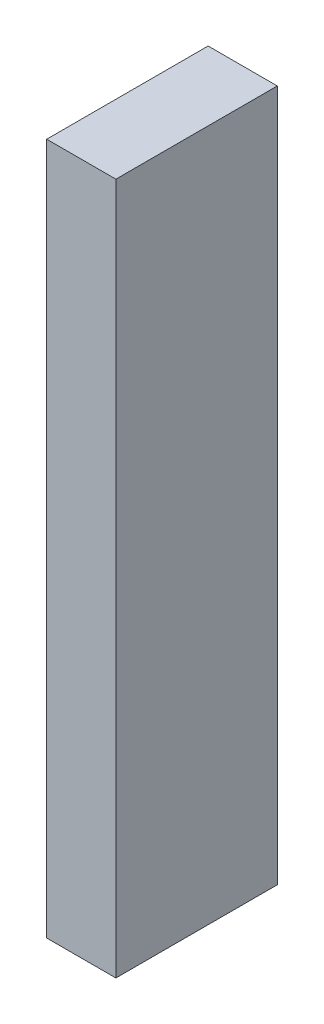
ISO-10303-21;
HEADER;
FILE_DESCRIPTION(('STEP AP214'),'2;1');
FILE_NAME('part.step','',(''),(''),'','','');
FILE_SCHEMA(('AUTOMOTIVE_DESIGN { 1 0 10303 214 1 1 1 1 }'));
ENDSEC;
DATA;
#1=APPLICATION_CONTEXT('core data for automotive mechanical design processes');
#2=APPLICATION_PROTOCOL_DEFINITION('international standard','automotive_design',2000,#1);
#3=PRODUCT_CONTEXT('',#1,'mechanical');
#4=PRODUCT('Part','Part','',(#3));
#5=PRODUCT_RELATED_PRODUCT_CATEGORY('part','',(#4));
#6=PRODUCT_DEFINITION_FORMATION('','',#4);
#7=PRODUCT_DEFINITION_CONTEXT('part definition',#1,'design');
#8=PRODUCT_DEFINITION('design','',#6,#7);
#9=PRODUCT_DEFINITION_SHAPE('','',#8);
#10=(LENGTH_UNIT() NAMED_UNIT(*) SI_UNIT(.MILLI.,.METRE.));
#11=(NAMED_UNIT(*) PLANE_ANGLE_UNIT() SI_UNIT($,.RADIAN.));
#12=(NAMED_UNIT(*) SI_UNIT($,.STERADIAN.) SOLID_ANGLE_UNIT());
#13=UNCERTAINTY_MEASURE_WITH_UNIT(LENGTH_MEASURE(1.E-05),#10,'distance_accuracy_value','');
#14=(GEOMETRIC_REPRESENTATION_CONTEXT(3) GLOBAL_UNCERTAINTY_ASSIGNED_CONTEXT((#13)) GLOBAL_UNIT_ASSIGNED_CONTEXT((#10,
#11,#12)) REPRESENTATION_CONTEXT('',''));
#15=CARTESIAN_POINT('',(0.,0.,0.));
#16=DIRECTION('',(0.,0.,1.));
#17=DIRECTION('',(1.,0.,0.));
#18=AXIS2_PLACEMENT_3D('',#15,#16,#17);
#19=CARTESIAN_POINT('',(38.1,0.,0.));
#20=DIRECTION('',(0.,1.,0.));
#21=DIRECTION('',(0.,0.,1.));
#22=AXIS2_PLACEMENT_3D('',#19,#20,#21);
#23=PLANE('',#22);
#24=DIRECTION('',(0.,0.,-1.));
#25=VECTOR('',#24,1.);
#26=CARTESIAN_POINT('',(0.,0.,0.));
#27=LINE('',#26,#25);
#28=CARTESIAN_POINT('',(0.,0.,0.));
#29=VERTEX_POINT('',#28);
#30=CARTESIAN_POINT('',(0.,0.,-88.9));
#31=VERTEX_POINT('',#30);
#32=EDGE_CURVE('E98',#29,#31,#27,.T.);
#33=ORIENTED_EDGE('',*,*,#32,.T.);
#34=DIRECTION('',(-1.,0.,0.));
#35=VECTOR('',#34,1.);
#36=CARTESIAN_POINT('',(38.1,0.,-88.9));
#37=LINE('',#36,#35);
#38=CARTESIAN_POINT('',(38.1,0.,-88.9));
#39=VERTEX_POINT('',#38);
#40=EDGE_CURVE('E11',#39,#31,#37,.T.);
#41=ORIENTED_EDGE('',*,*,#40,.F.);
#42=DIRECTION('',(0.,0.,-1.));
#43=VECTOR('',#42,1.);
#44=CARTESIAN_POINT('',(38.1,0.,0.));
#45=LINE('',#44,#43);
#46=CARTESIAN_POINT('',(38.1,0.,0.));
#47=VERTEX_POINT('',#46);
#48=EDGE_CURVE('E84',#47,#39,#45,.T.);
#49=ORIENTED_EDGE('',*,*,#48,.F.);
#50=DIRECTION('',(-1.,0.,0.));
#51=VECTOR('',#50,1.);
#52=CARTESIAN_POINT('',(38.1,0.,0.));
#53=LINE('',#52,#51);
#54=EDGE_CURVE('E51',#47,#29,#53,.T.);
#55=ORIENTED_EDGE('',*,*,#54,.T.);
#56=EDGE_LOOP('',(#33,#41,#49,#55));
#57=FACE_BOUND('',#56,.T.);
#58=ADVANCED_FACE('F35',(#57),#23,.F.);
#59=CARTESIAN_POINT('',(38.1,0.,-88.9));
#60=DIRECTION('',(0.,0.,1.));
#61=DIRECTION('',(1.,0.,0.));
#62=AXIS2_PLACEMENT_3D('',#59,#60,#61);
#63=PLANE('',#62);
#64=DIRECTION('',(0.,1.,0.));
#65=VECTOR('',#64,1.);
#66=CARTESIAN_POINT('',(0.,0.,-88.9));
#67=LINE('',#66,#65);
#68=CARTESIAN_POINT('',(0.,381.,-88.9));
#69=VERTEX_POINT('',#68);
#70=EDGE_CURVE('E89',#31,#69,#67,.T.);
#71=ORIENTED_EDGE('',*,*,#70,.T.);
#72=DIRECTION('',(-1.,0.,0.));
#73=VECTOR('',#72,1.);
#74=CARTESIAN_POINT('',(38.1,381.,-88.9));
#75=LINE('',#74,#73);
#76=CARTESIAN_POINT('',(38.1,381.,-88.9));
#77=VERTEX_POINT('',#76);
#78=EDGE_CURVE('E43',#77,#69,#75,.T.);
#79=ORIENTED_EDGE('',*,*,#78,.F.);
#80=DIRECTION('',(0.,1.,0.));
#81=VECTOR('',#80,1.);
#82=CARTESIAN_POINT('',(38.1,0.,-88.9));
#83=LINE('',#82,#81);
#84=EDGE_CURVE('E76',#39,#77,#83,.T.);
#85=ORIENTED_EDGE('',*,*,#84,.F.);
#86=ORIENTED_EDGE('',*,*,#40,.T.);
#87=EDGE_LOOP('',(#71,#79,#85,#86));
#88=FACE_BOUND('',#87,.T.);
#89=ADVANCED_FACE('F88',(#88),#63,.F.);
#90=CARTESIAN_POINT('',(38.1,381.,0.));
#91=DIRECTION('',(0.,1.,0.));
#92=DIRECTION('',(0.,0.,1.));
#93=AXIS2_PLACEMENT_3D('',#90,#91,#92);
#94=PLANE('',#93);
#95=DIRECTION('',(0.,0.,-1.));
#96=VECTOR('',#95,1.);
#97=CARTESIAN_POINT('',(0.,381.,0.));
#98=LINE('',#97,#96);
#99=CARTESIAN_POINT('',(0.,381.,0.));
#100=VERTEX_POINT('',#99);
#101=EDGE_CURVE('E101',#100,#69,#98,.T.);
#102=ORIENTED_EDGE('',*,*,#101,.F.);
#103=DIRECTION('',(-1.,0.,0.));
#104=VECTOR('',#103,1.);
#105=CARTESIAN_POINT('',(38.1,381.,0.));
#106=LINE('',#105,#104);
#107=CARTESIAN_POINT('',(38.1,381.,0.));
#108=VERTEX_POINT('',#107);
#109=EDGE_CURVE('E65',#108,#100,#106,.T.);
#110=ORIENTED_EDGE('',*,*,#109,.F.);
#111=DIRECTION('',(0.,0.,-1.));
#112=VECTOR('',#111,1.);
#113=CARTESIAN_POINT('',(38.1,381.,0.));
#114=LINE('',#113,#112);
#115=EDGE_CURVE('E83',#108,#77,#114,.T.);
#116=ORIENTED_EDGE('',*,*,#115,.T.);
#117=ORIENTED_EDGE('',*,*,#78,.T.);
#118=EDGE_LOOP('',(#102,#110,#116,#117));
#119=FACE_BOUND('',#118,.T.);
#120=ADVANCED_FACE('F92',(#119),#94,.T.);
#121=CARTESIAN_POINT('',(38.1,0.,0.));
#122=DIRECTION('',(0.,0.,1.));
#123=DIRECTION('',(1.,0.,0.));
#124=AXIS2_PLACEMENT_3D('',#121,#122,#123);
#125=PLANE('',#124);
#126=DIRECTION('',(0.,1.,0.));
#127=VECTOR('',#126,1.);
#128=CARTESIAN_POINT('',(0.,0.,0.));
#129=LINE('',#128,#127);
#130=EDGE_CURVE('E103',#29,#100,#129,.T.);
#131=ORIENTED_EDGE('',*,*,#130,.F.);
#132=ORIENTED_EDGE('',*,*,#54,.F.);
#133=DIRECTION('',(0.,1.,0.));
#134=VECTOR('',#133,1.);
#135=CARTESIAN_POINT('',(38.1,0.,0.));
#136=LINE('',#135,#134);
#137=EDGE_CURVE('E93',#47,#108,#136,.T.);
#138=ORIENTED_EDGE('',*,*,#137,.T.);
#139=ORIENTED_EDGE('',*,*,#109,.T.);
#140=EDGE_LOOP('',(#131,#132,#138,#139));
#141=FACE_BOUND('',#140,.T.);
#142=ADVANCED_FACE('F109',(#141),#125,.T.);
#143=CARTESIAN_POINT('',(38.1,0.,0.));
#144=DIRECTION('',(1.,0.,0.));
#145=DIRECTION('',(0.,0.,-1.));
#146=AXIS2_PLACEMENT_3D('',#143,#144,#145);
#147=PLANE('',#146);
#148=ORIENTED_EDGE('',*,*,#48,.T.);
#149=ORIENTED_EDGE('',*,*,#84,.T.);
#150=ORIENTED_EDGE('',*,*,#115,.F.);
#151=ORIENTED_EDGE('',*,*,#137,.F.);
#152=EDGE_LOOP('',(#148,#149,#150,#151));
#153=FACE_BOUND('',#152,.T.);
#154=ADVANCED_FACE('F80',(#153),#147,.T.);
#155=CARTESIAN_POINT('',(0.,0.,0.));
#156=DIRECTION('',(1.,0.,0.));
#157=DIRECTION('',(0.,0.,-1.));
#158=AXIS2_PLACEMENT_3D('',#155,#156,#157);
#159=PLANE('',#158);
#160=ORIENTED_EDGE('',*,*,#32,.F.);
#161=ORIENTED_EDGE('',*,*,#130,.T.);
#162=ORIENTED_EDGE('',*,*,#101,.T.);
#163=ORIENTED_EDGE('',*,*,#70,.F.);
#164=EDGE_LOOP('',(#160,#161,#162,#163));
#165=FACE_BOUND('',#164,.T.);
#166=ADVANCED_FACE('F108',(#165),#159,.F.);
#167=CLOSED_SHELL('',(#58,#89,#120,#142,#154,#166));
#168=MANIFOLD_SOLID_BREP('B2',#167);
#169=ADVANCED_BREP_SHAPE_REPRESENTATION('',(#18,#168),#14);
#170=SHAPE_DEFINITION_REPRESENTATION(#9,#169);
ENDSEC;
END-ISO-10303-21;
